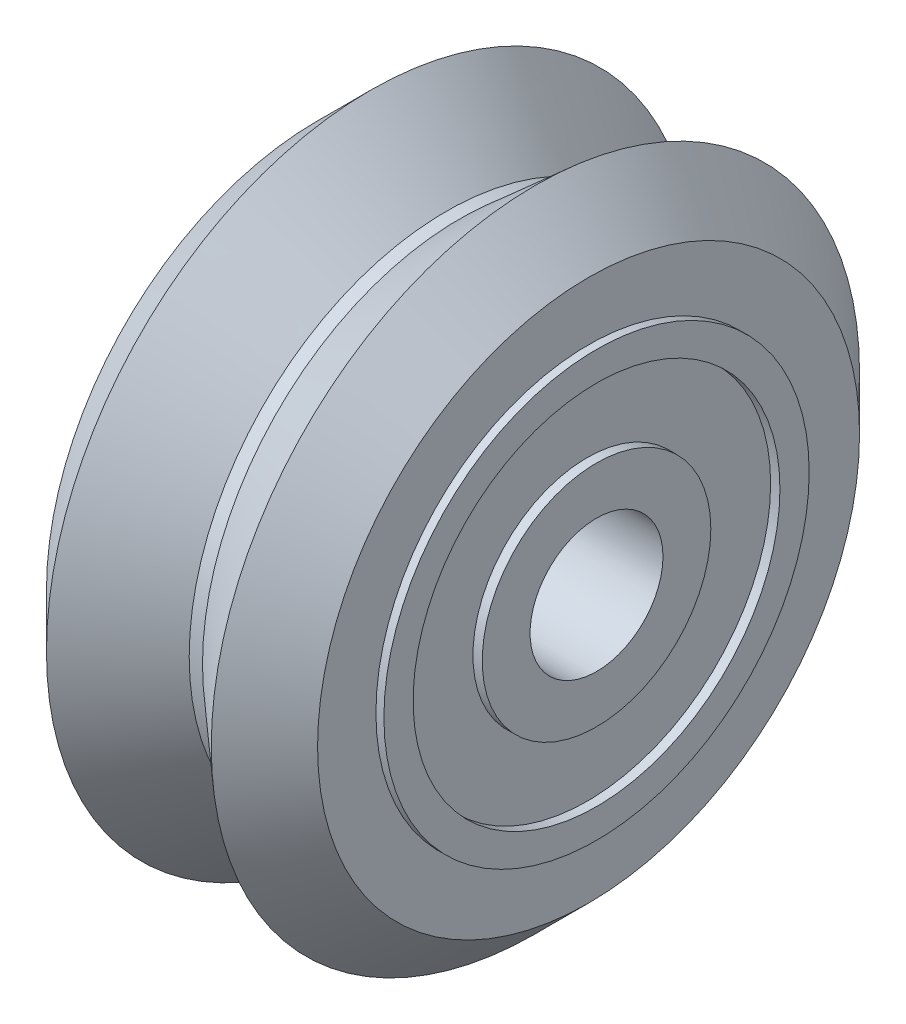
ISO-10303-21;
HEADER;
FILE_DESCRIPTION(('STEP AP214'),'2;1');
FILE_NAME('part.step','',(''),(''),'','','');
FILE_SCHEMA(('AUTOMOTIVE_DESIGN { 1 0 10303 214 1 1 1 1 }'));
ENDSEC;
DATA;
#1=APPLICATION_CONTEXT('core data for automotive mechanical design processes');
#2=APPLICATION_PROTOCOL_DEFINITION('international standard','automotive_design',2000,#1);
#3=PRODUCT_CONTEXT('',#1,'mechanical');
#4=PRODUCT('Part','Part','',(#3));
#5=PRODUCT_RELATED_PRODUCT_CATEGORY('part','',(#4));
#6=PRODUCT_DEFINITION_FORMATION('','',#4);
#7=PRODUCT_DEFINITION_CONTEXT('part definition',#1,'design');
#8=PRODUCT_DEFINITION('design','',#6,#7);
#9=PRODUCT_DEFINITION_SHAPE('','',#8);
#10=(LENGTH_UNIT() NAMED_UNIT(*) SI_UNIT(.MILLI.,.METRE.));
#11=(NAMED_UNIT(*) PLANE_ANGLE_UNIT() SI_UNIT($,.RADIAN.));
#12=(NAMED_UNIT(*) SI_UNIT($,.STERADIAN.) SOLID_ANGLE_UNIT());
#13=UNCERTAINTY_MEASURE_WITH_UNIT(LENGTH_MEASURE(1.E-05),#10,'distance_accuracy_value','');
#14=(GEOMETRIC_REPRESENTATION_CONTEXT(3) GLOBAL_UNCERTAINTY_ASSIGNED_CONTEXT((#13)) GLOBAL_UNIT_ASSIGNED_CONTEXT((#10,
#11,#12)) REPRESENTATION_CONTEXT('',''));
#15=CARTESIAN_POINT('',(0.,0.,0.));
#16=DIRECTION('',(0.,0.,1.));
#17=DIRECTION('',(1.,0.,0.));
#18=AXIS2_PLACEMENT_3D('',#15,#16,#17);
#19=CARTESIAN_POINT('',(0.399999999999999,8.,0.));
#20=DIRECTION('',(1.,0.,0.));
#21=DIRECTION('',(0.,0.,-1.));
#22=AXIS2_PLACEMENT_3D('',#19,#20,#21);
#23=PLANE('',#22);
#24=CARTESIAN_POINT('',(0.399999999999999,0.,0.));
#25=DIRECTION('',(1.,0.,0.));
#26=DIRECTION('',(0.,0.,-1.));
#27=AXIS2_PLACEMENT_3D('',#24,#25,#26);
#28=CIRCLE('',#27,8.);
#29=CARTESIAN_POINT('',(0.399999999999999,0.,-8.));
#30=VERTEX_POINT('',#29);
#31=EDGE_CURVE('P0_E54',#30,#30,#28,.T.);
#32=ORIENTED_EDGE('',*,*,#31,.F.);
#33=EDGE_LOOP('',(#32));
#34=FACE_BOUND('',#33,.T.);
#35=CARTESIAN_POINT('',(0.399999999999999,0.,0.));
#36=DIRECTION('',(1.,0.,0.));
#37=DIRECTION('',(0.,0.,-1.));
#38=AXIS2_PLACEMENT_3D('',#35,#36,#37);
#39=CIRCLE('',#38,6.9);
#40=CARTESIAN_POINT('',(0.399999999999999,0.,-6.9));
#41=VERTEX_POINT('',#40);
#42=EDGE_CURVE('P0_E9',#41,#41,#39,.T.);
#43=ORIENTED_EDGE('',*,*,#42,.T.);
#44=EDGE_LOOP('',(#43));
#45=FACE_BOUND('',#44,.T.);
#46=ADVANCED_FACE('P0_F14',(#34,#45),#23,.F.);
#47=CARTESIAN_POINT('',(14.9286738351254,0.,0.));
#48=DIRECTION('',(1.,0.,0.));
#49=DIRECTION('',(0.,0.,-1.));
#50=AXIS2_PLACEMENT_3D('',#47,#48,#49);
#51=CYLINDRICAL_SURFACE('',#50,6.9);
#52=ORIENTED_EDGE('',*,*,#42,.F.);
#53=EDGE_LOOP('',(#52));
#54=FACE_BOUND('',#53,.T.);
#55=CARTESIAN_POINT('',(0.749999999999999,0.,0.));
#56=DIRECTION('',(1.,0.,0.));
#57=DIRECTION('',(0.,0.,-1.));
#58=AXIS2_PLACEMENT_3D('',#55,#56,#57);
#59=CIRCLE('',#58,6.9);
#60=CARTESIAN_POINT('',(0.749999999999999,0.,-6.9));
#61=VERTEX_POINT('',#60);
#62=EDGE_CURVE('P0_E20',#61,#61,#59,.T.);
#63=ORIENTED_EDGE('',*,*,#62,.T.);
#64=EDGE_LOOP('',(#63));
#65=FACE_BOUND('',#64,.T.);
#66=ADVANCED_FACE('P0_F61',(#54,#65),#51,.F.);
#67=CARTESIAN_POINT('',(0.75,6.9,0.));
#68=DIRECTION('',(1.,0.,0.));
#69=DIRECTION('',(0.,0.,-1.));
#70=AXIS2_PLACEMENT_3D('',#67,#68,#69);
#71=PLANE('',#70);
#72=ORIENTED_EDGE('',*,*,#62,.F.);
#73=EDGE_LOOP('',(#72));
#74=FACE_BOUND('',#73,.T.);
#75=CARTESIAN_POINT('',(0.749999999999999,0.,0.));
#76=DIRECTION('',(1.,0.,0.));
#77=DIRECTION('',(0.,0.,-1.));
#78=AXIS2_PLACEMENT_3D('',#75,#76,#77);
#79=CIRCLE('',#78,4.3);
#80=CARTESIAN_POINT('',(0.749999999999999,0.,-4.3));
#81=VERTEX_POINT('',#80);
#82=EDGE_CURVE('P0_E24',#81,#81,#79,.T.);
#83=ORIENTED_EDGE('',*,*,#82,.T.);
#84=EDGE_LOOP('',(#83));
#85=FACE_BOUND('',#84,.T.);
#86=ADVANCED_FACE('P0_F66',(#74,#85),#71,.F.);
#87=CARTESIAN_POINT('',(14.9286738351254,0.,0.));
#88=DIRECTION('',(1.,0.,0.));
#89=DIRECTION('',(0.,0.,-1.));
#90=AXIS2_PLACEMENT_3D('',#87,#88,#89);
#91=CYLINDRICAL_SURFACE('',#90,4.3);
#92=ORIENTED_EDGE('',*,*,#82,.F.);
#93=EDGE_LOOP('',(#92));
#94=FACE_BOUND('',#93,.T.);
#95=CARTESIAN_POINT('',(0.399999999999999,0.,0.));
#96=DIRECTION('',(1.,0.,0.));
#97=DIRECTION('',(0.,0.,-1.));
#98=AXIS2_PLACEMENT_3D('',#95,#96,#97);
#99=CIRCLE('',#98,4.3);
#100=CARTESIAN_POINT('',(0.399999999999999,0.,-4.3));
#101=VERTEX_POINT('',#100);
#102=EDGE_CURVE('P0_E28',#101,#101,#99,.T.);
#103=ORIENTED_EDGE('',*,*,#102,.T.);
#104=EDGE_LOOP('',(#103));
#105=FACE_BOUND('',#104,.T.);
#106=ADVANCED_FACE('P0_F71',(#94,#105),#91,.T.);
#107=CARTESIAN_POINT('',(0.399999999999998,4.3,0.));
#108=DIRECTION('',(1.,0.,0.));
#109=DIRECTION('',(0.,0.,-1.));
#110=AXIS2_PLACEMENT_3D('',#107,#108,#109);
#111=PLANE('',#110);
#112=ORIENTED_EDGE('',*,*,#102,.F.);
#113=EDGE_LOOP('',(#112));
#114=FACE_BOUND('',#113,.T.);
#115=CARTESIAN_POINT('',(0.399999999999999,0.,0.));
#116=DIRECTION('',(1.,0.,0.));
#117=DIRECTION('',(0.,0.,-1.));
#118=AXIS2_PLACEMENT_3D('',#115,#116,#117);
#119=CIRCLE('',#118,2.5);
#120=CARTESIAN_POINT('',(0.399999999999999,0.,-2.5));
#121=VERTEX_POINT('',#120);
#122=EDGE_CURVE('P0_E33',#121,#121,#119,.T.);
#123=ORIENTED_EDGE('',*,*,#122,.T.);
#124=EDGE_LOOP('',(#123));
#125=FACE_BOUND('',#124,.T.);
#126=ADVANCED_FACE('P0_F77',(#114,#125),#111,.F.);
#127=CARTESIAN_POINT('',(14.9286738351254,0.,0.));
#128=DIRECTION('',(1.,0.,0.));
#129=DIRECTION('',(0.,0.,-1.));
#130=AXIS2_PLACEMENT_3D('',#127,#128,#129);
#131=CYLINDRICAL_SURFACE('',#130,2.5);
#132=ORIENTED_EDGE('',*,*,#122,.F.);
#133=EDGE_LOOP('',(#132));
#134=FACE_BOUND('',#133,.T.);
#135=CARTESIAN_POINT('',(5.4,0.,0.));
#136=DIRECTION('',(1.,0.,0.));
#137=DIRECTION('',(0.,0.,-1.));
#138=AXIS2_PLACEMENT_3D('',#135,#136,#137);
#139=CIRCLE('',#138,2.5);
#140=CARTESIAN_POINT('',(5.4,0.,-2.5));
#141=VERTEX_POINT('',#140);
#142=EDGE_CURVE('P0_E36',#141,#141,#139,.T.);
#143=ORIENTED_EDGE('',*,*,#142,.T.);
#144=EDGE_LOOP('',(#143));
#145=FACE_BOUND('',#144,.T.);
#146=ADVANCED_FACE('P0_F81',(#134,#145),#131,.F.);
#147=CARTESIAN_POINT('',(5.4,4.3,0.));
#148=DIRECTION('',(-1.,0.,0.));
#149=DIRECTION('',(0.,0.,1.));
#150=AXIS2_PLACEMENT_3D('',#147,#148,#149);
#151=PLANE('',#150);
#152=ORIENTED_EDGE('',*,*,#142,.F.);
#153=EDGE_LOOP('',(#152));
#154=FACE_BOUND('',#153,.T.);
#155=CARTESIAN_POINT('',(5.4,0.,0.));
#156=DIRECTION('',(1.,0.,0.));
#157=DIRECTION('',(0.,0.,-1.));
#158=AXIS2_PLACEMENT_3D('',#155,#156,#157);
#159=CIRCLE('',#158,4.3);
#160=CARTESIAN_POINT('',(5.4,0.,-4.3));
#161=VERTEX_POINT('',#160);
#162=EDGE_CURVE('P0_E39',#161,#161,#159,.T.);
#163=ORIENTED_EDGE('',*,*,#162,.T.);
#164=EDGE_LOOP('',(#163));
#165=FACE_BOUND('',#164,.T.);
#166=ADVANCED_FACE('P0_F85',(#154,#165),#151,.F.);
#167=CARTESIAN_POINT('',(14.9286738351254,0.,0.));
#168=DIRECTION('',(1.,0.,0.));
#169=DIRECTION('',(0.,0.,-1.));
#170=AXIS2_PLACEMENT_3D('',#167,#168,#169);
#171=CYLINDRICAL_SURFACE('',#170,4.3);
#172=ORIENTED_EDGE('',*,*,#162,.F.);
#173=EDGE_LOOP('',(#172));
#174=FACE_BOUND('',#173,.T.);
#175=CARTESIAN_POINT('',(5.05,0.,0.));
#176=DIRECTION('',(1.,0.,0.));
#177=DIRECTION('',(0.,0.,-1.));
#178=AXIS2_PLACEMENT_3D('',#175,#176,#177);
#179=CIRCLE('',#178,4.3);
#180=CARTESIAN_POINT('',(5.05,0.,-4.3));
#181=VERTEX_POINT('',#180);
#182=EDGE_CURVE('P0_E42',#181,#181,#179,.T.);
#183=ORIENTED_EDGE('',*,*,#182,.T.);
#184=EDGE_LOOP('',(#183));
#185=FACE_BOUND('',#184,.T.);
#186=ADVANCED_FACE('P0_F89',(#174,#185),#171,.T.);
#187=CARTESIAN_POINT('',(5.05,6.9,0.));
#188=DIRECTION('',(-1.,0.,0.));
#189=DIRECTION('',(0.,0.,1.));
#190=AXIS2_PLACEMENT_3D('',#187,#188,#189);
#191=PLANE('',#190);
#192=ORIENTED_EDGE('',*,*,#182,.F.);
#193=EDGE_LOOP('',(#192));
#194=FACE_BOUND('',#193,.T.);
#195=CARTESIAN_POINT('',(5.05,0.,0.));
#196=DIRECTION('',(1.,0.,0.));
#197=DIRECTION('',(0.,0.,-1.));
#198=AXIS2_PLACEMENT_3D('',#195,#196,#197);
#199=CIRCLE('',#198,6.9);
#200=CARTESIAN_POINT('',(5.05,0.,-6.9));
#201=VERTEX_POINT('',#200);
#202=EDGE_CURVE('P0_E45',#201,#201,#199,.T.);
#203=ORIENTED_EDGE('',*,*,#202,.T.);
#204=EDGE_LOOP('',(#203));
#205=FACE_BOUND('',#204,.T.);
#206=ADVANCED_FACE('P0_F93',(#194,#205),#191,.F.);
#207=CARTESIAN_POINT('',(14.9286738351254,0.,0.));
#208=DIRECTION('',(1.,0.,0.));
#209=DIRECTION('',(0.,0.,-1.));
#210=AXIS2_PLACEMENT_3D('',#207,#208,#209);
#211=CYLINDRICAL_SURFACE('',#210,6.9);
#212=ORIENTED_EDGE('',*,*,#202,.F.);
#213=EDGE_LOOP('',(#212));
#214=FACE_BOUND('',#213,.T.);
#215=CARTESIAN_POINT('',(5.4,0.,0.));
#216=DIRECTION('',(1.,0.,0.));
#217=DIRECTION('',(0.,0.,-1.));
#218=AXIS2_PLACEMENT_3D('',#215,#216,#217);
#219=CIRCLE('',#218,6.9);
#220=CARTESIAN_POINT('',(5.4,0.,-6.9));
#221=VERTEX_POINT('',#220);
#222=EDGE_CURVE('P0_E48',#221,#221,#219,.T.);
#223=ORIENTED_EDGE('',*,*,#222,.T.);
#224=EDGE_LOOP('',(#223));
#225=FACE_BOUND('',#224,.T.);
#226=ADVANCED_FACE('P0_F97',(#214,#225),#211,.F.);
#227=CARTESIAN_POINT('',(5.4,8.,0.));
#228=DIRECTION('',(-1.,0.,0.));
#229=DIRECTION('',(0.,0.,1.));
#230=AXIS2_PLACEMENT_3D('',#227,#228,#229);
#231=PLANE('',#230);
#232=ORIENTED_EDGE('',*,*,#222,.F.);
#233=EDGE_LOOP('',(#232));
#234=FACE_BOUND('',#233,.T.);
#235=CARTESIAN_POINT('',(5.4,0.,0.));
#236=DIRECTION('',(1.,0.,0.));
#237=DIRECTION('',(0.,0.,-1.));
#238=AXIS2_PLACEMENT_3D('',#235,#236,#237);
#239=CIRCLE('',#238,8.);
#240=CARTESIAN_POINT('',(5.4,0.,-8.));
#241=VERTEX_POINT('',#240);
#242=EDGE_CURVE('P0_E51',#241,#241,#239,.T.);
#243=ORIENTED_EDGE('',*,*,#242,.T.);
#244=EDGE_LOOP('',(#243));
#245=FACE_BOUND('',#244,.T.);
#246=ADVANCED_FACE('P0_F101',(#234,#245),#231,.F.);
#247=CARTESIAN_POINT('',(14.9286738351254,0.,0.));
#248=DIRECTION('',(1.,0.,0.));
#249=DIRECTION('',(0.,0.,-1.));
#250=AXIS2_PLACEMENT_3D('',#247,#248,#249);
#251=CYLINDRICAL_SURFACE('',#250,8.);
#252=ORIENTED_EDGE('',*,*,#242,.F.);
#253=EDGE_LOOP('',(#252));
#254=FACE_BOUND('',#253,.T.);
#255=ORIENTED_EDGE('',*,*,#31,.T.);
#256=EDGE_LOOP('',(#255));
#257=FACE_BOUND('',#256,.T.);
#258=ADVANCED_FACE('P0_F58',(#254,#257),#251,.T.);
#259=CLOSED_SHELL('',(#46,#66,#86,#106,#126,#146,#166,#186,#206,#226,#246,#258));
#260=MANIFOLD_SOLID_BREP('P0_B1',#259);
#261=CARTESIAN_POINT('',(-5.4,8.,0.));
#262=DIRECTION('',(1.,0.,0.));
#263=DIRECTION('',(0.,0.,-1.));
#264=AXIS2_PLACEMENT_3D('',#261,#262,#263);
#265=PLANE('',#264);
#266=CARTESIAN_POINT('',(-5.4,0.,0.));
#267=DIRECTION('',(1.,0.,0.));
#268=DIRECTION('',(0.,0.,-1.));
#269=AXIS2_PLACEMENT_3D('',#266,#267,#268);
#270=CIRCLE('',#269,8.);
#271=CARTESIAN_POINT('',(-5.4,0.,-8.));
#272=VERTEX_POINT('',#271);
#273=EDGE_CURVE('P1_E55',#272,#272,#270,.T.);
#274=ORIENTED_EDGE('',*,*,#273,.F.);
#275=EDGE_LOOP('',(#274));
#276=FACE_BOUND('',#275,.T.);
#277=CARTESIAN_POINT('',(-5.4,0.,0.));
#278=DIRECTION('',(1.,0.,0.));
#279=DIRECTION('',(0.,0.,-1.));
#280=AXIS2_PLACEMENT_3D('',#277,#278,#279);
#281=CIRCLE('',#280,6.9);
#282=CARTESIAN_POINT('',(-5.4,0.,-6.9));
#283=VERTEX_POINT('',#282);
#284=EDGE_CURVE('P1_E10',#283,#283,#281,.T.);
#285=ORIENTED_EDGE('',*,*,#284,.T.);
#286=EDGE_LOOP('',(#285));
#287=FACE_BOUND('',#286,.T.);
#288=ADVANCED_FACE('P1_F15',(#276,#287),#265,.F.);
#289=CARTESIAN_POINT('',(9.12867383512545,0.,0.));
#290=DIRECTION('',(1.,0.,0.));
#291=DIRECTION('',(0.,0.,-1.));
#292=AXIS2_PLACEMENT_3D('',#289,#290,#291);
#293=CYLINDRICAL_SURFACE('',#292,6.9);
#294=ORIENTED_EDGE('',*,*,#284,.F.);
#295=EDGE_LOOP('',(#294));
#296=FACE_BOUND('',#295,.T.);
#297=CARTESIAN_POINT('',(-5.05,0.,0.));
#298=DIRECTION('',(1.,0.,0.));
#299=DIRECTION('',(0.,0.,-1.));
#300=AXIS2_PLACEMENT_3D('',#297,#298,#299);
#301=CIRCLE('',#300,6.9);
#302=CARTESIAN_POINT('',(-5.05,0.,-6.9));
#303=VERTEX_POINT('',#302);
#304=EDGE_CURVE('P1_E21',#303,#303,#301,.T.);
#305=ORIENTED_EDGE('',*,*,#304,.T.);
#306=EDGE_LOOP('',(#305));
#307=FACE_BOUND('',#306,.T.);
#308=ADVANCED_FACE('P1_F62',(#296,#307),#293,.F.);
#309=CARTESIAN_POINT('',(-5.05,6.9,0.));
#310=DIRECTION('',(1.,0.,0.));
#311=DIRECTION('',(0.,0.,-1.));
#312=AXIS2_PLACEMENT_3D('',#309,#310,#311);
#313=PLANE('',#312);
#314=ORIENTED_EDGE('',*,*,#304,.F.);
#315=EDGE_LOOP('',(#314));
#316=FACE_BOUND('',#315,.T.);
#317=CARTESIAN_POINT('',(-5.05,0.,0.));
#318=DIRECTION('',(1.,0.,0.));
#319=DIRECTION('',(0.,0.,-1.));
#320=AXIS2_PLACEMENT_3D('',#317,#318,#319);
#321=CIRCLE('',#320,4.3);
#322=CARTESIAN_POINT('',(-5.05,0.,-4.3));
#323=VERTEX_POINT('',#322);
#324=EDGE_CURVE('P1_E25',#323,#323,#321,.T.);
#325=ORIENTED_EDGE('',*,*,#324,.T.);
#326=EDGE_LOOP('',(#325));
#327=FACE_BOUND('',#326,.T.);
#328=ADVANCED_FACE('P1_F67',(#316,#327),#313,.F.);
#329=CARTESIAN_POINT('',(9.12867383512545,0.,0.));
#330=DIRECTION('',(1.,0.,0.));
#331=DIRECTION('',(0.,0.,-1.));
#332=AXIS2_PLACEMENT_3D('',#329,#330,#331);
#333=CYLINDRICAL_SURFACE('',#332,4.3);
#334=ORIENTED_EDGE('',*,*,#324,.F.);
#335=EDGE_LOOP('',(#334));
#336=FACE_BOUND('',#335,.T.);
#337=CARTESIAN_POINT('',(-5.4,0.,0.));
#338=DIRECTION('',(1.,0.,0.));
#339=DIRECTION('',(0.,0.,-1.));
#340=AXIS2_PLACEMENT_3D('',#337,#338,#339);
#341=CIRCLE('',#340,4.3);
#342=CARTESIAN_POINT('',(-5.4,0.,-4.3));
#343=VERTEX_POINT('',#342);
#344=EDGE_CURVE('P1_E29',#343,#343,#341,.T.);
#345=ORIENTED_EDGE('',*,*,#344,.T.);
#346=EDGE_LOOP('',(#345));
#347=FACE_BOUND('',#346,.T.);
#348=ADVANCED_FACE('P1_F72',(#336,#347),#333,.T.);
#349=CARTESIAN_POINT('',(-5.4,4.3,0.));
#350=DIRECTION('',(1.,0.,0.));
#351=DIRECTION('',(0.,0.,-1.));
#352=AXIS2_PLACEMENT_3D('',#349,#350,#351);
#353=PLANE('',#352);
#354=ORIENTED_EDGE('',*,*,#344,.F.);
#355=EDGE_LOOP('',(#354));
#356=FACE_BOUND('',#355,.T.);
#357=CARTESIAN_POINT('',(-5.4,0.,0.));
#358=DIRECTION('',(1.,0.,0.));
#359=DIRECTION('',(0.,0.,-1.));
#360=AXIS2_PLACEMENT_3D('',#357,#358,#359);
#361=CIRCLE('',#360,2.5);
#362=CARTESIAN_POINT('',(-5.4,0.,-2.5));
#363=VERTEX_POINT('',#362);
#364=EDGE_CURVE('P1_E34',#363,#363,#361,.T.);
#365=ORIENTED_EDGE('',*,*,#364,.T.);
#366=EDGE_LOOP('',(#365));
#367=FACE_BOUND('',#366,.T.);
#368=ADVANCED_FACE('P1_F78',(#356,#367),#353,.F.);
#369=CARTESIAN_POINT('',(9.12867383512545,0.,0.));
#370=DIRECTION('',(1.,0.,0.));
#371=DIRECTION('',(0.,0.,-1.));
#372=AXIS2_PLACEMENT_3D('',#369,#370,#371);
#373=CYLINDRICAL_SURFACE('',#372,2.5);
#374=ORIENTED_EDGE('',*,*,#364,.F.);
#375=EDGE_LOOP('',(#374));
#376=FACE_BOUND('',#375,.T.);
#377=CARTESIAN_POINT('',(-0.399999999999999,0.,0.));
#378=DIRECTION('',(1.,0.,0.));
#379=DIRECTION('',(0.,0.,-1.));
#380=AXIS2_PLACEMENT_3D('',#377,#378,#379);
#381=CIRCLE('',#380,2.5);
#382=CARTESIAN_POINT('',(-0.399999999999999,0.,-2.5));
#383=VERTEX_POINT('',#382);
#384=EDGE_CURVE('P1_E37',#383,#383,#381,.T.);
#385=ORIENTED_EDGE('',*,*,#384,.T.);
#386=EDGE_LOOP('',(#385));
#387=FACE_BOUND('',#386,.T.);
#388=ADVANCED_FACE('P1_F82',(#376,#387),#373,.F.);
#389=CARTESIAN_POINT('',(-0.399999999999998,4.3,0.));
#390=DIRECTION('',(-1.,0.,0.));
#391=DIRECTION('',(0.,0.,1.));
#392=AXIS2_PLACEMENT_3D('',#389,#390,#391);
#393=PLANE('',#392);
#394=ORIENTED_EDGE('',*,*,#384,.F.);
#395=EDGE_LOOP('',(#394));
#396=FACE_BOUND('',#395,.T.);
#397=CARTESIAN_POINT('',(-0.399999999999999,0.,0.));
#398=DIRECTION('',(1.,0.,0.));
#399=DIRECTION('',(0.,0.,-1.));
#400=AXIS2_PLACEMENT_3D('',#397,#398,#399);
#401=CIRCLE('',#400,4.3);
#402=CARTESIAN_POINT('',(-0.399999999999999,0.,-4.3));
#403=VERTEX_POINT('',#402);
#404=EDGE_CURVE('P1_E40',#403,#403,#401,.T.);
#405=ORIENTED_EDGE('',*,*,#404,.T.);
#406=EDGE_LOOP('',(#405));
#407=FACE_BOUND('',#406,.T.);
#408=ADVANCED_FACE('P1_F86',(#396,#407),#393,.F.);
#409=CARTESIAN_POINT('',(9.12867383512545,0.,0.));
#410=DIRECTION('',(1.,0.,0.));
#411=DIRECTION('',(0.,0.,-1.));
#412=AXIS2_PLACEMENT_3D('',#409,#410,#411);
#413=CYLINDRICAL_SURFACE('',#412,4.3);
#414=ORIENTED_EDGE('',*,*,#404,.F.);
#415=EDGE_LOOP('',(#414));
#416=FACE_BOUND('',#415,.T.);
#417=CARTESIAN_POINT('',(-0.749999999999999,0.,0.));
#418=DIRECTION('',(1.,0.,0.));
#419=DIRECTION('',(0.,0.,-1.));
#420=AXIS2_PLACEMENT_3D('',#417,#418,#419);
#421=CIRCLE('',#420,4.3);
#422=CARTESIAN_POINT('',(-0.749999999999999,0.,-4.3));
#423=VERTEX_POINT('',#422);
#424=EDGE_CURVE('P1_E43',#423,#423,#421,.T.);
#425=ORIENTED_EDGE('',*,*,#424,.T.);
#426=EDGE_LOOP('',(#425));
#427=FACE_BOUND('',#426,.T.);
#428=ADVANCED_FACE('P1_F90',(#416,#427),#413,.T.);
#429=CARTESIAN_POINT('',(-0.75,6.9,0.));
#430=DIRECTION('',(-1.,0.,0.));
#431=DIRECTION('',(0.,0.,1.));
#432=AXIS2_PLACEMENT_3D('',#429,#430,#431);
#433=PLANE('',#432);
#434=ORIENTED_EDGE('',*,*,#424,.F.);
#435=EDGE_LOOP('',(#434));
#436=FACE_BOUND('',#435,.T.);
#437=CARTESIAN_POINT('',(-0.749999999999999,0.,0.));
#438=DIRECTION('',(1.,0.,0.));
#439=DIRECTION('',(0.,0.,-1.));
#440=AXIS2_PLACEMENT_3D('',#437,#438,#439);
#441=CIRCLE('',#440,6.9);
#442=CARTESIAN_POINT('',(-0.749999999999999,0.,-6.9));
#443=VERTEX_POINT('',#442);
#444=EDGE_CURVE('P1_E46',#443,#443,#441,.T.);
#445=ORIENTED_EDGE('',*,*,#444,.T.);
#446=EDGE_LOOP('',(#445));
#447=FACE_BOUND('',#446,.T.);
#448=ADVANCED_FACE('P1_F94',(#436,#447),#433,.F.);
#449=CARTESIAN_POINT('',(9.12867383512545,0.,0.));
#450=DIRECTION('',(1.,0.,0.));
#451=DIRECTION('',(0.,0.,-1.));
#452=AXIS2_PLACEMENT_3D('',#449,#450,#451);
#453=CYLINDRICAL_SURFACE('',#452,6.9);
#454=ORIENTED_EDGE('',*,*,#444,.F.);
#455=EDGE_LOOP('',(#454));
#456=FACE_BOUND('',#455,.T.);
#457=CARTESIAN_POINT('',(-0.399999999999999,0.,0.));
#458=DIRECTION('',(1.,0.,0.));
#459=DIRECTION('',(0.,0.,-1.));
#460=AXIS2_PLACEMENT_3D('',#457,#458,#459);
#461=CIRCLE('',#460,6.9);
#462=CARTESIAN_POINT('',(-0.399999999999999,0.,-6.9));
#463=VERTEX_POINT('',#462);
#464=EDGE_CURVE('P1_E49',#463,#463,#461,.T.);
#465=ORIENTED_EDGE('',*,*,#464,.T.);
#466=EDGE_LOOP('',(#465));
#467=FACE_BOUND('',#466,.T.);
#468=ADVANCED_FACE('P1_F98',(#456,#467),#453,.F.);
#469=CARTESIAN_POINT('',(-0.399999999999999,8.,0.));
#470=DIRECTION('',(-1.,0.,0.));
#471=DIRECTION('',(0.,0.,1.));
#472=AXIS2_PLACEMENT_3D('',#469,#470,#471);
#473=PLANE('',#472);
#474=ORIENTED_EDGE('',*,*,#464,.F.);
#475=EDGE_LOOP('',(#474));
#476=FACE_BOUND('',#475,.T.);
#477=CARTESIAN_POINT('',(-0.399999999999999,0.,0.));
#478=DIRECTION('',(1.,0.,0.));
#479=DIRECTION('',(0.,0.,-1.));
#480=AXIS2_PLACEMENT_3D('',#477,#478,#479);
#481=CIRCLE('',#480,8.);
#482=CARTESIAN_POINT('',(-0.399999999999999,0.,-8.));
#483=VERTEX_POINT('',#482);
#484=EDGE_CURVE('P1_E52',#483,#483,#481,.T.);
#485=ORIENTED_EDGE('',*,*,#484,.T.);
#486=EDGE_LOOP('',(#485));
#487=FACE_BOUND('',#486,.T.);
#488=ADVANCED_FACE('P1_F102',(#476,#487),#473,.F.);
#489=CARTESIAN_POINT('',(9.12867383512545,0.,0.));
#490=DIRECTION('',(1.,0.,0.));
#491=DIRECTION('',(0.,0.,-1.));
#492=AXIS2_PLACEMENT_3D('',#489,#490,#491);
#493=CYLINDRICAL_SURFACE('',#492,8.);
#494=ORIENTED_EDGE('',*,*,#484,.F.);
#495=EDGE_LOOP('',(#494));
#496=FACE_BOUND('',#495,.T.);
#497=ORIENTED_EDGE('',*,*,#273,.T.);
#498=EDGE_LOOP('',(#497));
#499=FACE_BOUND('',#498,.T.);
#500=ADVANCED_FACE('P1_F59',(#496,#499),#493,.T.);
#501=CLOSED_SHELL('',(#288,#308,#328,#348,#368,#388,#408,#428,#448,#468,#488,#500));
#502=MANIFOLD_SOLID_BREP('P1_B1',#501);
#503=CARTESIAN_POINT('',(-0.499999999999998,0.,0.));
#504=DIRECTION('',(1.,0.,0.));
#505=DIRECTION('',(0.,0.,1.));
#506=AXIS2_PLACEMENT_3D('',#503,#504,#505);
#507=CYLINDRICAL_SURFACE('',#506,2.6);
#508=CARTESIAN_POINT('',(-0.499999999999998,0.,0.));
#509=DIRECTION('',(1.,0.,0.));
#510=DIRECTION('',(0.,0.,1.));
#511=AXIS2_PLACEMENT_3D('',#508,#509,#510);
#512=CIRCLE('',#511,2.6);
#513=CARTESIAN_POINT('',(-0.499999999999997,0.,-2.6));
#514=VERTEX_POINT('',#513);
#515=EDGE_CURVE('P2_E39',#514,#514,#512,.T.);
#516=ORIENTED_EDGE('',*,*,#515,.F.);
#517=DIRECTION('',(1.,0.,0.));
#518=VECTOR('',#517,1.);
#519=CARTESIAN_POINT('',(-0.499999999999997,0.,-2.6));
#520=LINE('',#519,#518);
#521=CARTESIAN_POINT('',(0.500000000000003,0.,-2.6));
#522=VERTEX_POINT('',#521);
#523=EDGE_CURVE('P2_E11',#514,#522,#520,.T.);
#524=ORIENTED_EDGE('',*,*,#523,.T.);
#525=CARTESIAN_POINT('',(0.500000000000002,0.,0.));
#526=DIRECTION('',(-1.,0.,0.));
#527=DIRECTION('',(0.,0.,1.));
#528=AXIS2_PLACEMENT_3D('',#525,#526,#527);
#529=CIRCLE('',#528,2.6);
#530=EDGE_CURVE('P2_E69',#522,#522,#529,.T.);
#531=ORIENTED_EDGE('',*,*,#530,.F.);
#532=ORIENTED_EDGE('',*,*,#523,.F.);
#533=EDGE_LOOP('',(#516,#524,#531,#532));
#534=FACE_BOUND('',#533,.T.);
#535=ADVANCED_FACE('P2_F17',(#534),#507,.F.);
#536=CARTESIAN_POINT('',(-0.499999999999998,0.,0.));
#537=DIRECTION('',(1.,0.,0.));
#538=DIRECTION('',(0.,0.,1.));
#539=AXIS2_PLACEMENT_3D('',#536,#537,#538);
#540=CYLINDRICAL_SURFACE('',#539,5.);
#541=CARTESIAN_POINT('',(0.500000000000002,0.,0.));
#542=DIRECTION('',(1.,0.,0.));
#543=DIRECTION('',(0.,0.,1.));
#544=AXIS2_PLACEMENT_3D('',#541,#542,#543);
#545=CIRCLE('',#544,5.);
#546=CARTESIAN_POINT('',(0.500000000000003,0.,-5.));
#547=VERTEX_POINT('',#546);
#548=EDGE_CURVE('P2_E52',#547,#547,#545,.T.);
#549=ORIENTED_EDGE('',*,*,#548,.F.);
#550=DIRECTION('',(-1.,0.,0.));
#551=VECTOR('',#550,1.);
#552=CARTESIAN_POINT('',(-0.499999999999997,0.,-5.));
#553=LINE('',#552,#551);
#554=CARTESIAN_POINT('',(-0.499999999999997,0.,-5.));
#555=VERTEX_POINT('',#554);
#556=EDGE_CURVE('P2_E21',#547,#555,#553,.T.);
#557=ORIENTED_EDGE('',*,*,#556,.T.);
#558=CARTESIAN_POINT('',(-0.499999999999998,0.,0.));
#559=DIRECTION('',(-1.,0.,0.));
#560=DIRECTION('',(0.,0.,1.));
#561=AXIS2_PLACEMENT_3D('',#558,#559,#560);
#562=CIRCLE('',#561,5.);
#563=EDGE_CURVE('P2_E57',#555,#555,#562,.T.);
#564=ORIENTED_EDGE('',*,*,#563,.F.);
#565=ORIENTED_EDGE('',*,*,#556,.F.);
#566=EDGE_LOOP('',(#549,#557,#564,#565));
#567=FACE_BOUND('',#566,.T.);
#568=ADVANCED_FACE('P2_F58',(#567),#540,.T.);
#569=CARTESIAN_POINT('',(-0.499999999999998,0.,0.));
#570=DIRECTION('',(1.,0.,0.));
#571=DIRECTION('',(0.,0.,-1.));
#572=AXIS2_PLACEMENT_3D('',#569,#570,#571);
#573=PLANE('',#572);
#574=ORIENTED_EDGE('',*,*,#563,.T.);
#575=EDGE_LOOP('',(#574));
#576=FACE_BOUND('',#575,.T.);
#577=ORIENTED_EDGE('',*,*,#515,.T.);
#578=EDGE_LOOP('',(#577));
#579=FACE_BOUND('',#578,.T.);
#580=ADVANCED_FACE('P2_F80',(#576,#579),#573,.F.);
#581=CARTESIAN_POINT('',(0.500000000000002,0.,0.));
#582=DIRECTION('',(1.,0.,0.));
#583=DIRECTION('',(0.,0.,-1.));
#584=AXIS2_PLACEMENT_3D('',#581,#582,#583);
#585=PLANE('',#584);
#586=ORIENTED_EDGE('',*,*,#548,.T.);
#587=EDGE_LOOP('',(#586));
#588=FACE_BOUND('',#587,.T.);
#589=ORIENTED_EDGE('',*,*,#530,.T.);
#590=EDGE_LOOP('',(#589));
#591=FACE_BOUND('',#590,.T.);
#592=ADVANCED_FACE('P2_F19',(#588,#591),#585,.T.);
#593=CLOSED_SHELL('',(#535,#568,#580,#592));
#594=MANIFOLD_SOLID_BREP('P2_B1',#593);
#595=CARTESIAN_POINT('',(-5.1,10.195,0.));
#596=DIRECTION('',(1.,0.,0.));
#597=DIRECTION('',(0.,0.,-1.));
#598=AXIS2_PLACEMENT_3D('',#595,#596,#597);
#599=PLANE('',#598);
#600=CARTESIAN_POINT('',(-5.09999999999999,0.,0.));
#601=DIRECTION('',(-1.,0.,0.));
#602=DIRECTION('',(0.,0.,1.));
#603=AXIS2_PLACEMENT_3D('',#600,#601,#602);
#604=CIRCLE('',#603,8.);
#605=CARTESIAN_POINT('',(-5.09999999999999,0.,8.));
#606=VERTEX_POINT('',#605);
#607=EDGE_CURVE('P3_E10',#606,#606,#604,.T.);
#608=ORIENTED_EDGE('',*,*,#607,.F.);
#609=EDGE_LOOP('',(#608));
#610=FACE_BOUND('',#609,.T.);
#611=CARTESIAN_POINT('',(-5.09999999999999,0.,0.));
#612=DIRECTION('',(-1.,0.,0.));
#613=DIRECTION('',(0.,0.,1.));
#614=AXIS2_PLACEMENT_3D('',#611,#612,#613);
#615=CIRCLE('',#614,10.195);
#616=CARTESIAN_POINT('',(-5.09999999999999,0.,10.195));
#617=VERTEX_POINT('',#616);
#618=EDGE_CURVE('P3_E55',#617,#617,#615,.T.);
#619=ORIENTED_EDGE('',*,*,#618,.T.);
#620=EDGE_LOOP('',(#619));
#621=FACE_BOUND('',#620,.T.);
#622=ADVANCED_FACE('P3_F15',(#610,#621),#599,.F.);
#623=CARTESIAN_POINT('',(-73.8465771485865,0.,0.));
#624=DIRECTION('',(-1.,0.,0.));
#625=DIRECTION('',(0.,0.,1.));
#626=AXIS2_PLACEMENT_3D('',#623,#624,#625);
#627=CYLINDRICAL_SURFACE('',#626,8.);
#628=CARTESIAN_POINT('',(-0.399999999999998,0.,0.));
#629=DIRECTION('',(-1.,0.,0.));
#630=DIRECTION('',(0.,0.,1.));
#631=AXIS2_PLACEMENT_3D('',#628,#629,#630);
#632=CIRCLE('',#631,8.);
#633=CARTESIAN_POINT('',(-0.399999999999998,0.,8.));
#634=VERTEX_POINT('',#633);
#635=EDGE_CURVE('P3_E21',#634,#634,#632,.T.);
#636=ORIENTED_EDGE('',*,*,#635,.F.);
#637=EDGE_LOOP('',(#636));
#638=FACE_BOUND('',#637,.T.);
#639=ORIENTED_EDGE('',*,*,#607,.T.);
#640=EDGE_LOOP('',(#639));
#641=FACE_BOUND('',#640,.T.);
#642=ADVANCED_FACE('P3_F116',(#638,#641),#627,.F.);
#643=CARTESIAN_POINT('',(-0.399999999999999,8.,0.));
#644=DIRECTION('',(1.,0.,0.));
#645=DIRECTION('',(0.,0.,-1.));
#646=AXIS2_PLACEMENT_3D('',#643,#644,#645);
#647=PLANE('',#646);
#648=CARTESIAN_POINT('',(-0.399999999999998,0.,0.));
#649=DIRECTION('',(-1.,0.,0.));
#650=DIRECTION('',(0.,0.,1.));
#651=AXIS2_PLACEMENT_3D('',#648,#649,#650);
#652=CIRCLE('',#651,7.);
#653=CARTESIAN_POINT('',(-0.399999999999998,0.,7.));
#654=VERTEX_POINT('',#653);
#655=EDGE_CURVE('P3_E25',#654,#654,#652,.T.);
#656=ORIENTED_EDGE('',*,*,#655,.F.);
#657=EDGE_LOOP('',(#656));
#658=FACE_BOUND('',#657,.T.);
#659=ORIENTED_EDGE('',*,*,#635,.T.);
#660=EDGE_LOOP('',(#659));
#661=FACE_BOUND('',#660,.T.);
#662=ADVANCED_FACE('P3_F111',(#658,#661),#647,.F.);
#663=CARTESIAN_POINT('',(-73.8465771485865,0.,0.));
#664=DIRECTION('',(-1.,0.,0.));
#665=DIRECTION('',(0.,0.,1.));
#666=AXIS2_PLACEMENT_3D('',#663,#664,#665);
#667=CYLINDRICAL_SURFACE('',#666,7.);
#668=CARTESIAN_POINT('',(0.399999999999998,0.,0.));
#669=DIRECTION('',(-1.,0.,0.));
#670=DIRECTION('',(0.,0.,1.));
#671=AXIS2_PLACEMENT_3D('',#668,#669,#670);
#672=CIRCLE('',#671,7.);
#673=CARTESIAN_POINT('',(0.399999999999998,0.,7.));
#674=VERTEX_POINT('',#673);
#675=EDGE_CURVE('P3_E29',#674,#674,#672,.T.);
#676=ORIENTED_EDGE('',*,*,#675,.F.);
#677=EDGE_LOOP('',(#676));
#678=FACE_BOUND('',#677,.T.);
#679=ORIENTED_EDGE('',*,*,#655,.T.);
#680=EDGE_LOOP('',(#679));
#681=FACE_BOUND('',#680,.T.);
#682=ADVANCED_FACE('P3_F105',(#678,#681),#667,.F.);
#683=CARTESIAN_POINT('',(0.399999999999999,7.,0.));
#684=DIRECTION('',(-1.,0.,0.));
#685=DIRECTION('',(0.,0.,1.));
#686=AXIS2_PLACEMENT_3D('',#683,#684,#685);
#687=PLANE('',#686);
#688=CARTESIAN_POINT('',(0.399999999999998,0.,0.));
#689=DIRECTION('',(-1.,0.,0.));
#690=DIRECTION('',(0.,0.,1.));
#691=AXIS2_PLACEMENT_3D('',#688,#689,#690);
#692=CIRCLE('',#691,8.);
#693=CARTESIAN_POINT('',(0.399999999999998,0.,8.));
#694=VERTEX_POINT('',#693);
#695=EDGE_CURVE('P3_E34',#694,#694,#692,.T.);
#696=ORIENTED_EDGE('',*,*,#695,.F.);
#697=EDGE_LOOP('',(#696));
#698=FACE_BOUND('',#697,.T.);
#699=ORIENTED_EDGE('',*,*,#675,.T.);
#700=EDGE_LOOP('',(#699));
#701=FACE_BOUND('',#700,.T.);
#702=ADVANCED_FACE('P3_F99',(#698,#701),#687,.F.);
#703=CARTESIAN_POINT('',(-73.8465771485865,0.,0.));
#704=DIRECTION('',(-1.,0.,0.));
#705=DIRECTION('',(0.,0.,1.));
#706=AXIS2_PLACEMENT_3D('',#703,#704,#705);
#707=CYLINDRICAL_SURFACE('',#706,8.);
#708=CARTESIAN_POINT('',(5.09999999999999,0.,0.));
#709=DIRECTION('',(-1.,0.,0.));
#710=DIRECTION('',(0.,0.,1.));
#711=AXIS2_PLACEMENT_3D('',#708,#709,#710);
#712=CIRCLE('',#711,8.);
#713=CARTESIAN_POINT('',(5.09999999999999,0.,8.));
#714=VERTEX_POINT('',#713);
#715=EDGE_CURVE('P3_E37',#714,#714,#712,.T.);
#716=ORIENTED_EDGE('',*,*,#715,.F.);
#717=EDGE_LOOP('',(#716));
#718=FACE_BOUND('',#717,.T.);
#719=ORIENTED_EDGE('',*,*,#695,.T.);
#720=EDGE_LOOP('',(#719));
#721=FACE_BOUND('',#720,.T.);
#722=ADVANCED_FACE('P3_F93',(#718,#721),#707,.F.);
#723=CARTESIAN_POINT('',(5.1,8.,0.));
#724=DIRECTION('',(-1.,0.,0.));
#725=DIRECTION('',(0.,0.,1.));
#726=AXIS2_PLACEMENT_3D('',#723,#724,#725);
#727=PLANE('',#726);
#728=CARTESIAN_POINT('',(5.09999999999999,0.,0.));
#729=DIRECTION('',(-1.,0.,0.));
#730=DIRECTION('',(0.,0.,1.));
#731=AXIS2_PLACEMENT_3D('',#728,#729,#730);
#732=CIRCLE('',#731,10.195);
#733=CARTESIAN_POINT('',(5.09999999999999,0.,10.195));
#734=VERTEX_POINT('',#733);
#735=EDGE_CURVE('P3_E40',#734,#734,#732,.T.);
#736=ORIENTED_EDGE('',*,*,#735,.F.);
#737=EDGE_LOOP('',(#736));
#738=FACE_BOUND('',#737,.T.);
#739=ORIENTED_EDGE('',*,*,#715,.T.);
#740=EDGE_LOOP('',(#739));
#741=FACE_BOUND('',#740,.T.);
#742=ADVANCED_FACE('P3_F87',(#738,#741),#727,.F.);
#743=CARTESIAN_POINT('',(5.09999999999999,0.,0.));
#744=DIRECTION('',(-1.,0.,0.));
#745=DIRECTION('',(0.,0.,1.));
#746=AXIS2_PLACEMENT_3D('',#743,#744,#745);
#747=CONICAL_SURFACE('',#746,10.195,0.785398163397451);
#748=CARTESIAN_POINT('',(3.10000000000001,0.,0.));
#749=DIRECTION('',(-1.,0.,0.));
#750=DIRECTION('',(0.,0.,1.));
#751=AXIS2_PLACEMENT_3D('',#748,#749,#750);
#752=CIRCLE('',#751,12.195);
#753=CARTESIAN_POINT('',(3.10000000000001,0.,12.195));
#754=VERTEX_POINT('',#753);
#755=EDGE_CURVE('P3_E43',#754,#754,#752,.T.);
#756=ORIENTED_EDGE('',*,*,#755,.F.);
#757=EDGE_LOOP('',(#756));
#758=FACE_BOUND('',#757,.T.);
#759=ORIENTED_EDGE('',*,*,#735,.T.);
#760=EDGE_LOOP('',(#759));
#761=FACE_BOUND('',#760,.T.);
#762=ADVANCED_FACE('P3_F81',(#758,#761),#747,.T.);
#763=CARTESIAN_POINT('',(3.10000000000001,0.,0.));
#764=DIRECTION('',(1.,0.,0.));
#765=DIRECTION('',(0.,0.,-1.));
#766=AXIS2_PLACEMENT_3D('',#763,#764,#765);
#767=CONICAL_SURFACE('',#766,12.195,0.72402283128363);
#768=CARTESIAN_POINT('',(0.25,0.,0.));
#769=DIRECTION('',(-1.,0.,0.));
#770=DIRECTION('',(0.,0.,1.));
#771=AXIS2_PLACEMENT_3D('',#768,#769,#770);
#772=CIRCLE('',#771,9.675);
#773=CARTESIAN_POINT('',(0.25,0.,9.675));
#774=VERTEX_POINT('',#773);
#775=EDGE_CURVE('P3_E46',#774,#774,#772,.T.);
#776=ORIENTED_EDGE('',*,*,#775,.F.);
#777=EDGE_LOOP('',(#776));
#778=FACE_BOUND('',#777,.T.);
#779=ORIENTED_EDGE('',*,*,#755,.T.);
#780=EDGE_LOOP('',(#779));
#781=FACE_BOUND('',#780,.T.);
#782=ADVANCED_FACE('P3_F75',(#778,#781),#767,.T.);
#783=CARTESIAN_POINT('',(-73.8465771485865,0.,0.));
#784=DIRECTION('',(-1.,0.,0.));
#785=DIRECTION('',(0.,0.,1.));
#786=AXIS2_PLACEMENT_3D('',#783,#784,#785);
#787=CYLINDRICAL_SURFACE('',#786,9.675);
#788=CARTESIAN_POINT('',(-0.25,0.,0.));
#789=DIRECTION('',(-1.,0.,0.));
#790=DIRECTION('',(0.,0.,1.));
#791=AXIS2_PLACEMENT_3D('',#788,#789,#790);
#792=CIRCLE('',#791,9.675);
#793=CARTESIAN_POINT('',(-0.25,0.,9.675));
#794=VERTEX_POINT('',#793);
#795=EDGE_CURVE('P3_E49',#794,#794,#792,.T.);
#796=ORIENTED_EDGE('',*,*,#795,.F.);
#797=EDGE_LOOP('',(#796));
#798=FACE_BOUND('',#797,.T.);
#799=ORIENTED_EDGE('',*,*,#775,.T.);
#800=EDGE_LOOP('',(#799));
#801=FACE_BOUND('',#800,.T.);
#802=ADVANCED_FACE('P3_F69',(#798,#801),#787,.T.);
#803=CARTESIAN_POINT('',(-0.25,0.,0.));
#804=DIRECTION('',(-1.,0.,0.));
#805=DIRECTION('',(0.,0.,1.));
#806=AXIS2_PLACEMENT_3D('',#803,#804,#805);
#807=CONICAL_SURFACE('',#806,9.675,0.72402283128363);
#808=CARTESIAN_POINT('',(-3.10000000000001,0.,0.));
#809=DIRECTION('',(-1.,0.,0.));
#810=DIRECTION('',(0.,0.,1.));
#811=AXIS2_PLACEMENT_3D('',#808,#809,#810);
#812=CIRCLE('',#811,12.195);
#813=CARTESIAN_POINT('',(-3.10000000000001,0.,12.195));
#814=VERTEX_POINT('',#813);
#815=EDGE_CURVE('P3_E52',#814,#814,#812,.T.);
#816=ORIENTED_EDGE('',*,*,#815,.F.);
#817=EDGE_LOOP('',(#816));
#818=FACE_BOUND('',#817,.T.);
#819=ORIENTED_EDGE('',*,*,#795,.T.);
#820=EDGE_LOOP('',(#819));
#821=FACE_BOUND('',#820,.T.);
#822=ADVANCED_FACE('P3_F63',(#818,#821),#807,.T.);
#823=CARTESIAN_POINT('',(-3.10000000000001,0.,0.));
#824=DIRECTION('',(1.,0.,0.));
#825=DIRECTION('',(0.,0.,-1.));
#826=AXIS2_PLACEMENT_3D('',#823,#824,#825);
#827=CONICAL_SURFACE('',#826,12.195,0.785398163397451);
#828=ORIENTED_EDGE('',*,*,#618,.F.);
#829=EDGE_LOOP('',(#828));
#830=FACE_BOUND('',#829,.T.);
#831=ORIENTED_EDGE('',*,*,#815,.T.);
#832=EDGE_LOOP('',(#831));
#833=FACE_BOUND('',#832,.T.);
#834=ADVANCED_FACE('P3_F60',(#830,#833),#827,.T.);
#835=CLOSED_SHELL('',(#622,#642,#662,#682,#702,#722,#742,#762,#782,#802,#822,#834));
#836=MANIFOLD_SOLID_BREP('P3_B1',#835);
#837=ADVANCED_BREP_SHAPE_REPRESENTATION('',(#18,#260,#502,#594,#836),#14);
#838=SHAPE_DEFINITION_REPRESENTATION(#9,#837);
ENDSEC;
END-ISO-10303-21;
